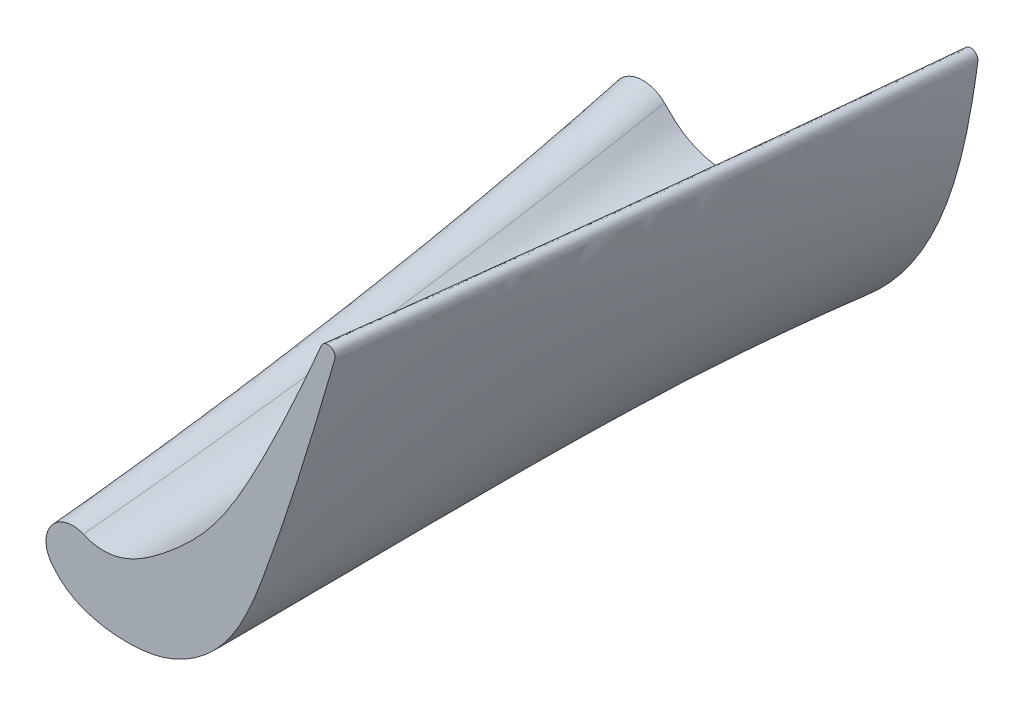
ISO-10303-21;
HEADER;
FILE_DESCRIPTION(('STEP AP214'),'2;1');
FILE_NAME('part.step','',(''),(''),'','','');
FILE_SCHEMA(('AUTOMOTIVE_DESIGN { 1 0 10303 214 1 1 1 1 }'));
ENDSEC;
DATA;
#1=APPLICATION_CONTEXT('core data for automotive mechanical design processes');
#2=APPLICATION_PROTOCOL_DEFINITION('international standard','automotive_design',2000,#1);
#3=PRODUCT_CONTEXT('',#1,'mechanical');
#4=PRODUCT('Part','Part','',(#3));
#5=PRODUCT_RELATED_PRODUCT_CATEGORY('part','',(#4));
#6=PRODUCT_DEFINITION_FORMATION('','',#4);
#7=PRODUCT_DEFINITION_CONTEXT('part definition',#1,'design');
#8=PRODUCT_DEFINITION('design','',#6,#7);
#9=PRODUCT_DEFINITION_SHAPE('','',#8);
#10=(LENGTH_UNIT() NAMED_UNIT(*) SI_UNIT(.MILLI.,.METRE.));
#11=(NAMED_UNIT(*) PLANE_ANGLE_UNIT() SI_UNIT($,.RADIAN.));
#12=(NAMED_UNIT(*) SI_UNIT($,.STERADIAN.) SOLID_ANGLE_UNIT());
#13=UNCERTAINTY_MEASURE_WITH_UNIT(LENGTH_MEASURE(1.E-05),#10,'distance_accuracy_value','');
#14=(GEOMETRIC_REPRESENTATION_CONTEXT(3) GLOBAL_UNCERTAINTY_ASSIGNED_CONTEXT((#13)) GLOBAL_UNIT_ASSIGNED_CONTEXT((#10,
#11,#12)) REPRESENTATION_CONTEXT('',''));
#15=CARTESIAN_POINT('',(0.,0.,0.));
#16=DIRECTION('',(0.,0.,1.));
#17=DIRECTION('',(1.,0.,0.));
#18=AXIS2_PLACEMENT_3D('',#15,#16,#17);
#19=CARTESIAN_POINT('',(8.89113504854674,16.2502413005269,21.));
#20=DIRECTION('',(0.,0.,1.));
#21=DIRECTION('',(1.,0.,0.));
#22=AXIS2_PLACEMENT_3D('',#19,#20,#21);
#23=PLANE('',#22);
#24=CARTESIAN_POINT('',(8.89113504854674,16.2502413005269,21.));
#25=DIRECTION('',(0.,0.,1.));
#26=DIRECTION('',(1.,0.,0.));
#27=AXIS2_PLACEMENT_3D('',#24,#25,#26);
#28=CIRCLE('',#27,0.499999999999538);
#29=CARTESIAN_POINT('',(9.37151293059252,16.1115434618948,21.));
#30=VERTEX_POINT('',#29);
#31=CARTESIAN_POINT('',(8.43141791114901,16.4468631548118,21.));
#32=VERTEX_POINT('',#31);
#33=EDGE_CURVE('E280',#30,#32,#28,.T.);
#34=ORIENTED_EDGE('',*,*,#33,.T.);
#35=CARTESIAN_POINT('',(-8.04478709637704,-3.08924513544326,21.));
#36=CARTESIAN_POINT('',(-7.40942088153978,-3.36302986753127,21.));
#37=CARTESIAN_POINT('',(-5.441580778131,-3.56576695449207,21.));
#38=CARTESIAN_POINT('',(-2.39747683335481,-1.52679760591979,21.));
#39=CARTESIAN_POINT('',(1.04049287411143,1.6806212635499,21.));
#40=CARTESIAN_POINT('',(4.58751936080533,7.67435269661124,21.));
#41=CARTESIAN_POINT('',(7.3264335180572,13.863323985652,21.));
#42=CARTESIAN_POINT('',(8.4314179111491,16.446863154813,21.));
#43=B_SPLINE_CURVE_WITH_KNOTS('',3,(#35,#36,#37,#38,#39,#40,#41,#42),.UNSPECIFIED.,.F.,.F.,(4,1,
1,1,1,4),(0.,0.0695102415454085,0.217198321992235,0.37469911171847,0.589805400977995,
0.999729954207877),.UNSPECIFIED.);
#44=CARTESIAN_POINT('',(-8.04478709637704,-3.08924513544326,21.));
#45=VERTEX_POINT('',#44);
#46=EDGE_CURVE('E291',#45,#32,#43,.T.);
#47=ORIENTED_EDGE('',*,*,#46,.F.);
#48=CARTESIAN_POINT('',(-8.77689094619604,-4.78822246109543,21.));
#49=DIRECTION('',(0.,0.,1.));
#50=DIRECTION('',(1.,0.,0.));
#51=AXIS2_PLACEMENT_3D('',#48,#49,#50);
#52=CIRCLE('',#51,1.85);
#53=CARTESIAN_POINT('',(-10.2994062445566,-5.83914927408384,21.));
#54=VERTEX_POINT('',#53);
#55=EDGE_CURVE('E281',#45,#54,#52,.T.);
#56=ORIENTED_EDGE('',*,*,#55,.T.);
#57=CARTESIAN_POINT('',(-10.2994062445566,-5.83914927408384,21.));
#58=CARTESIAN_POINT('',(-9.68190240457333,-6.73374919441278,21.));
#59=CARTESIAN_POINT('',(-8.05811486291636,-7.77309202398907,21.));
#60=CARTESIAN_POINT('',(-5.27053926558615,-8.16212100501361,21.));
#61=CARTESIAN_POINT('',(-1.86407310789102,-7.82114317170824,21.));
#62=CARTESIAN_POINT('',(2.28181491644027,-5.01327722845313,21.));
#63=CARTESIAN_POINT('',(4.47128332433579,0.598572453425043,21.));
#64=CARTESIAN_POINT('',(6.91434804376061,7.7557736586609,21.));
#65=CARTESIAN_POINT('',(8.40963530933274,12.7800947598445,21.));
#66=CARTESIAN_POINT('',(9.37151293059252,16.1115434618948,21.));
#67=B_SPLINE_CURVE_WITH_KNOTS('',3,(#57,#58,#59,#60,#61,#62,#63,#64,#65,#66),.UNSPECIFIED.,.F.,
.F.,(4,1,1,1,1,1,1,4),(0.,0.0800428842584507,0.160676536463411,0.228141202812313,
0.362508476433222,0.553953741601191,0.712539123403051,0.996067203654121),.UNSPECIFIED.);
#68=EDGE_CURVE('E276',#54,#30,#67,.T.);
#69=ORIENTED_EDGE('',*,*,#68,.T.);
#70=EDGE_LOOP('',(#34,#47,#56,#69));
#71=FACE_BOUND('',#70,.T.);
#72=ADVANCED_FACE('F235',(#71),#23,.T.);
#73=CARTESIAN_POINT('',(11.4136921607234,14.3096245383213,-21.));
#74=DIRECTION('',(0.,0.,1.));
#75=DIRECTION('',(1.,0.,0.));
#76=AXIS2_PLACEMENT_3D('',#73,#74,#75);
#77=PLANE('',#76);
#78=CARTESIAN_POINT('',(11.4136921607234,14.3096245383213,-21.));
#79=DIRECTION('',(0.,0.,1.));
#80=DIRECTION('',(1.,0.,0.));
#81=AXIS2_PLACEMENT_3D('',#78,#79,#80);
#82=CIRCLE('',#81,0.497369637643366);
#83=CARTESIAN_POINT('',(11.9063836776732,14.2415684910134,-21.));
#84=VERTEX_POINT('',#83);
#85=CARTESIAN_POINT('',(10.966416022714,14.5271575537854,-21.));
#86=VERTEX_POINT('',#85);
#87=EDGE_CURVE('E368',#84,#86,#82,.T.);
#88=ORIENTED_EDGE('',*,*,#87,.F.);
#89=CARTESIAN_POINT('',(-13.1885050207505,-1.66766831620271,-21.));
#90=CARTESIAN_POINT('',(-12.6856816351062,-2.60265044196109,-21.));
#91=CARTESIAN_POINT('',(-11.1626049405616,-5.08555576234239,-21.));
#92=CARTESIAN_POINT('',(-4.58262143904003,-9.324884667272,-21.));
#93=CARTESIAN_POINT('',(4.60753360550347,-4.56159920987308,-21.));
#94=CARTESIAN_POINT('',(10.207513131404,4.23778551879077,-21.));
#95=CARTESIAN_POINT('',(11.3398412883982,10.1400868412567,-21.));
#96=CARTESIAN_POINT('',(11.9063836776732,14.2415684910134,-21.));
#97=B_SPLINE_CURVE_WITH_KNOTS('',3,(#89,#90,#91,#92,#93,#94,#95,#96),.UNSPECIFIED.,.F.,.F.,(4,1,
1,1,1,4),(0.,0.082846870089142,0.212684995574931,0.550655831525839,0.699333195746872,1.),.UNSPECIFIED.);
#98=CARTESIAN_POINT('',(-13.1885050207505,-1.66766831620271,-21.));
#99=VERTEX_POINT('',#98);
#100=EDGE_CURVE('E12',#99,#84,#97,.T.);
#101=ORIENTED_EDGE('',*,*,#100,.F.);
#102=CARTESIAN_POINT('',(-11.294961061793,-0.649340630486733,-21.));
#103=DIRECTION('',(0.,0.,1.));
#104=DIRECTION('',(1.,0.,0.));
#105=AXIS2_PLACEMENT_3D('',#102,#103,#104);
#106=CIRCLE('',#105,2.15);
#107=CARTESIAN_POINT('',(-9.79597368818251,0.891937038772225,-21.));
#108=VERTEX_POINT('',#107);
#109=EDGE_CURVE('E246',#108,#99,#106,.T.);
#110=ORIENTED_EDGE('',*,*,#109,.F.);
#111=CARTESIAN_POINT('',(-9.79597368818251,0.891937038772225,-21.));
#112=CARTESIAN_POINT('',(-9.36566445013562,0.473434826325087,-21.));
#113=CARTESIAN_POINT('',(-8.70544319266144,-0.265030892203256,-21.));
#114=CARTESIAN_POINT('',(-6.48285420055909,-1.28226998798972,-21.));
#115=CARTESIAN_POINT('',(-2.86489811487648,-0.738380913917585,-21.));
#116=CARTESIAN_POINT('',(4.15881380655178,3.29692032875372,-21.));
#117=CARTESIAN_POINT('',(8.96987095240958,10.4220015318257,-21.));
#118=CARTESIAN_POINT('',(10.966416022714,14.5271575537854,-21.));
#119=B_SPLINE_CURVE_WITH_KNOTS('',3,(#111,#112,#113,#114,#115,#116,#117,#118),.UNSPECIFIED.,.F.,
.F.,(4,1,1,1,1,4),(0.,0.0653104893183065,0.148080258072521,0.227071841773076,0.440631945416788,
1.),.UNSPECIFIED.);
#120=EDGE_CURVE('E366',#108,#86,#119,.T.);
#121=ORIENTED_EDGE('',*,*,#120,.T.);
#122=EDGE_LOOP('',(#88,#101,#110,#121));
#123=FACE_BOUND('',#122,.T.);
#124=ADVANCED_FACE('F378',(#123),#77,.F.);
#125=CARTESIAN_POINT('',(-9.79597368818251,0.891937038772225,-21.));
#126=CARTESIAN_POINT('',(-9.28335139778739,0.167194275170694,-14.007463386576));
#127=CARTESIAN_POINT('',(-8.4797509335369,-1.21906294275179,-0.0361954458949513));
#128=CARTESIAN_POINT('',(-8.11589366991707,-2.4869271743063,13.992536613424));
#129=CARTESIAN_POINT('',(-8.04478709637704,-3.08924513544326,21.));
#130=CARTESIAN_POINT('',(-10.556189230678,1.63129343259522,-21.));
#131=CARTESIAN_POINT('',(-10.0579375704492,0.763172875400342,-14.011702533805));
#132=CARTESIAN_POINT('',(-9.39908830492432,-0.689759016730798,-0.0319562780531277));
#133=CARTESIAN_POINT('',(-8.96117367764846,-2.19241363860465,13.988297466195));
#134=CARTESIAN_POINT('',(-8.80210857912886,-2.76290883612837,21.));
#135=CARTESIAN_POINT('',(-11.7433362714319,1.70566153926173,-21.));
#136=CARTESIAN_POINT('',(-11.2594552413694,0.694163188473495,-14.0159416810341));
#137=CARTESIAN_POINT('',(-10.4979542067126,-0.974316336457008,-0.0277171102113042));
#138=CARTESIAN_POINT('',(-9.93169156605241,-2.43889486029849,13.9840583189659));
#139=CARTESIAN_POINT('',(-9.68466794255325,-2.97756729420897,21.));
#140=CARTESIAN_POINT('',(-13.4364226177162,0.428257602920261,-21.));
#141=CARTESIAN_POINT('',(-12.8004772122192,-0.698825350270828,-14.0251832559326));
#142=CARTESIAN_POINT('',(-11.6459837399318,-2.73369120859002,-0.0184754903758557));
#143=CARTESIAN_POINT('',(-10.9517528989807,-3.80873905888607,13.9748167440674));
#144=CARTESIAN_POINT('',(-10.7303589637616,-4.25297119968987,21.));
#145=CARTESIAN_POINT('',(-13.6907821570999,-0.733701921497164,-21.));
#146=CARTESIAN_POINT('',(-12.8884017460024,-1.83299168349776,-14.030185683602));
#147=CARTESIAN_POINT('',(-11.5182314969314,-3.90735702225242,-0.0134730383822326));
#148=CARTESIAN_POINT('',(-10.8756640407487,-4.77887137171149,13.969814316398));
#149=CARTESIAN_POINT('',(-10.7678583187893,-5.16048598302186,21.));
#150=CARTESIAN_POINT('',(-13.1885050207505,-1.66766831620271,-21.));
#151=CARTESIAN_POINT('',(-12.2196896040522,-2.73916488701281,-14.0351881112714));
#152=CARTESIAN_POINT('',(-10.7650981650377,-4.51205773553931,-0.00847058638860511));
#153=CARTESIAN_POINT('',(-10.2936237532563,-5.5201521922669,13.9648118887286));
#154=CARTESIAN_POINT('',(-10.2994062445566,-5.83914927408384,21.));
#155=B_SPLINE_SURFACE_WITH_KNOTS('',3,3,((#125,#126,#127,#128,#129),(#130,#131,#132,#133,#134),
(#135,#136,#137,#138,#139),(#140,#141,#142,#143,#144),(#145,#146,#147,#148,#149),(#150,#151,
#152,#153,#154)),.UNSPECIFIED.,.F.,.F.,.F.,(4,2,4),(4,1,4),(0.,0.5,1.),(0.,0.50077962076101,1.),.UNSPECIFIED.);
#156=CARTESIAN_POINT('',(-13.1885050207505,-1.66766831620271,-21.));
#157=CARTESIAN_POINT('',(-12.2196896040522,-2.73916488701281,-14.0351881112714));
#158=CARTESIAN_POINT('',(-10.7650981650377,-4.51205773553931,-0.00847058638860511));
#159=CARTESIAN_POINT('',(-10.2936237532563,-5.5201521922669,13.9648118887286));
#160=CARTESIAN_POINT('',(-10.2994062445566,-5.83914927408384,21.));
#161=B_SPLINE_CURVE_WITH_KNOTS('',3,(#156,#157,#158,#159,#160),.UNSPECIFIED.,.F.,.F.,(4,1,4),
(0.,0.50077962076101,1.),.UNSPECIFIED.);
#162=EDGE_CURVE('E270',#99,#54,#161,.T.);
#163=CARTESIAN_POINT('',(-9.79597368818251,0.891937038772225,-21.));
#164=CARTESIAN_POINT('',(-9.28335139778739,0.167194275170694,-14.007463386576));
#165=CARTESIAN_POINT('',(-8.4797509335369,-1.21906294275179,-0.0361954458949513));
#166=CARTESIAN_POINT('',(-8.11589366991707,-2.4869271743063,13.992536613424));
#167=CARTESIAN_POINT('',(-8.04478709637704,-3.08924513544326,21.));
#168=B_SPLINE_CURVE_WITH_KNOTS('',3,(#163,#164,#165,#166,#167),.UNSPECIFIED.,.F.,.F.,(4,1,4),
(0.,0.50077962076101,1.),.UNSPECIFIED.);
#169=EDGE_CURVE('E284',#45,#108,#168,.F.);
#170=ORIENTED_EDGE('',*,*,#109,.T.);
#171=ORIENTED_EDGE('',*,*,#162,.T.);
#172=ORIENTED_EDGE('',*,*,#55,.F.);
#173=ORIENTED_EDGE('',*,*,#169,.T.);
#174=EDGE_LOOP('',(#170,#171,#172,#173));
#175=FACE_BOUND('',#174,.T.);
#176=ADVANCED_FACE('F311',(#175),#155,.T.);
#177=CARTESIAN_POINT('',(-13.1885050207505,-1.66766831620271,-21.));
#178=CARTESIAN_POINT('',(-12.2196896040522,-2.73916488701281,-14.0351881112714));
#179=CARTESIAN_POINT('',(-10.7650981650377,-4.5120577355393,-0.00847058638860338));
#180=CARTESIAN_POINT('',(-10.2936237532563,-5.52015219226689,13.9648118887286));
#181=CARTESIAN_POINT('',(-10.2994062445566,-5.83914927408384,21.));
#182=CARTESIAN_POINT('',(-13.0901938184561,-1.85047448538926,-21.));
#183=CARTESIAN_POINT('',(-12.107422925602,-2.90417177283829,-14.0349105053905));
#184=CARTESIAN_POINT('',(-10.6351818773627,-4.65432047778818,-0.00874819361935093));
#185=CARTESIAN_POINT('',(-10.1761983861753,-5.66880868940259,13.9650894946095));
#186=CARTESIAN_POINT('',(-10.1912463296336,-5.99584441508174,21.));
#187=CARTESIAN_POINT('',(-12.888982566521,-2.21395233421323,-21.));
#188=CARTESIAN_POINT('',(-11.8783007213552,-3.23205105494011,-14.0343552936287));
#189=CARTESIAN_POINT('',(-10.3755618392321,-4.93650220941279,-0.00930340808082607));
#190=CARTESIAN_POINT('',(-9.92213558687303,-5.95300290788768,13.9656447063713));
#191=CARTESIAN_POINT('',(-9.95571443464731,-6.29611592129125,21.));
#192=CARTESIAN_POINT('',(-12.5699435135724,-2.75015860510936,-21.));
#193=CARTESIAN_POINT('',(-11.5245249953852,-3.71711197288337,-14.0337573763308));
#194=CARTESIAN_POINT('',(-9.971165762966,-5.34728421997886,-0.00990132828616011));
#195=CARTESIAN_POINT('',(-9.51056696500324,-6.34869992462164,13.9662426236692));
#196=CARTESIAN_POINT('',(-9.54874399304939,-6.69734337364942,21.));
#197=CARTESIAN_POINT('',(-12.2302266525713,-3.27474733997325,-21.));
#198=CARTESIAN_POINT('',(-11.1545044954316,-4.19215259291102,-14.0334050649238));
#199=CARTESIAN_POINT('',(-9.55159740127812,-5.74211298481522,-0.0102536414062228));
#200=CARTESIAN_POINT('',(-9.06234953950706,-6.70199750682326,13.9665949350762));
#201=CARTESIAN_POINT('',(-9.09206454863514,-7.03956753945432,21.));
#202=CARTESIAN_POINT('',(-11.865834407424,-3.78327767532455,-21.));
#203=CARTESIAN_POINT('',(-10.7732107140463,-4.66320001295164,-14.033324594809));
#204=CARTESIAN_POINT('',(-9.13142907754531,-6.13803187899738,-0.0103341119123439));
#205=CARTESIAN_POINT('',(-8.5942024162283,-7.02387101053853,13.9666754051911));
#206=CARTESIAN_POINT('',(-8.59730311584424,-7.32427001632136,21.));
#207=CARTESIAN_POINT('',(-11.4727692020367,-4.27130874768292,-21.));
#208=CARTESIAN_POINT('',(-10.36537869953,-5.11425987056256,-14.0332446561859));
#209=CARTESIAN_POINT('',(-8.68734273315886,-6.508530696286,-0.0104140509241358));
#210=CARTESIAN_POINT('',(-8.10092033794307,-7.30200644473701,13.9667553438141));
#211=CARTESIAN_POINT('',(-8.07608670911642,-7.55293240186593,21.));
#212=CARTESIAN_POINT('',(-11.049937722627,-4.73460361294817,-21.));
#213=CARTESIAN_POINT('',(-9.91436567195699,-5.51944088741019,-14.032943198951));
#214=CARTESIAN_POINT('',(-8.18851858653979,-6.80784921439528,-0.0107155096248345));
#215=CARTESIAN_POINT('',(-7.57174679246311,-7.51798874741411,13.967056801049));
#216=CARTESIAN_POINT('',(-7.53600805039856,-7.73242438665221,21.));
#217=CARTESIAN_POINT('',(-10.5962466554124,-5.16892532702009,-21.));
#218=CARTESIAN_POINT('',(-9.42118613236376,-5.85852491817081,-14.0320799275992));
#219=CARTESIAN_POINT('',(-7.63966983565938,-7.00161399130661,-0.0115787851742943));
#220=CARTESIAN_POINT('',(-7.01346136152026,-7.65898495946294,13.9679200724008));
#221=CARTESIAN_POINT('',(-6.98465986163759,-7.86961566124438,21.));
#222=CARTESIAN_POINT('',(-10.1142476696527,-5.5728123754343,-21.));
#223=CARTESIAN_POINT('',(-8.9030252294984,-6.15193311804714,-14.0310751437653));
#224=CARTESIAN_POINT('',(-7.07263702341743,-7.13298746873768,-0.0125835738939097));
#225=CARTESIAN_POINT('',(-6.44378814235351,-7.74838924776853,13.9689248562347));
#226=CARTESIAN_POINT('',(-6.42539194196121,-7.96749649717382,21.));
#227=CARTESIAN_POINT('',(-9.60649243460775,-5.94480324372643,-21.));
#228=CARTESIAN_POINT('',(-8.36784303996309,-6.41513762185842,-14.0302177374553));
#229=CARTESIAN_POINT('',(-6.50084465199979,-7.23517417419628,-0.0134409843730217));
#230=CARTESIAN_POINT('',(-5.87121746028526,-7.80464022396599,13.9697822625447));
#231=CARTESIAN_POINT('',(-5.86155409049713,-8.0290571659719,21.));
#232=CARTESIAN_POINT('',(-8.897200869928,-6.39488308419765,-21.));
#233=CARTESIAN_POINT('',(-7.63285930374463,-6.72216441642025,-14.0292089518874));
#234=CARTESIAN_POINT('',(-5.73278526088833,-7.33002720355102,-0.0144497748461785));
#235=CARTESIAN_POINT('',(-5.10581247585016,-7.83753324591433,13.9707910481126));
#236=CARTESIAN_POINT('',(-5.10663061341715,-8.0679363174188,21.));
#237=CARTESIAN_POINT('',(-7.95390984496703,-6.86506839539835,-21.));
#238=CARTESIAN_POINT('',(-6.67945075149047,-7.02430897161352,-14.0281449302654));
#239=CARTESIAN_POINT('',(-4.76943006140594,-7.38138983244405,-0.0155138016419628));
#240=CARTESIAN_POINT('',(-4.15192906138924,-7.81114947116942,13.9718550697346));
#241=CARTESIAN_POINT('',(-4.16262731480687,-8.0453291484913,21.));
#242=CARTESIAN_POINT('',(-6.74810498046917,-7.25625062967893,-21.));
#243=CARTESIAN_POINT('',(-5.49278360377559,-7.24643099709024,-14.0270391721006));
#244=CARTESIAN_POINT('',(-3.61629312735279,-7.34150856127429,-0.0166195651834707));
#245=CARTESIAN_POINT('',(-3.0213250344133,-7.66384519504813,13.9729608278994));
#246=CARTESIAN_POINT('',(-3.04091712506029,-7.88237192555519,21.));
#247=CARTESIAN_POINT('',(-5.49230737897812,-7.44799339125097,-21.));
#248=CARTESIAN_POINT('',(-4.28057529688112,-7.30017483884872,-14.025806684967));
#249=CARTESIAN_POINT('',(-2.47708692399274,-7.1691260583941,-0.017852058309972));
#250=CARTESIAN_POINT('',(-1.92489056028245,-7.36699920991553,13.974193315033));
#251=CARTESIAN_POINT('',(-1.95878027455011,-7.54822994833439,21.));
#252=CARTESIAN_POINT('',(-4.22156429115791,-7.45436828778213,-21.));
#253=CARTESIAN_POINT('',(-3.07253944596422,-7.17775437469691,-14.0243213945168));
#254=CARTESIAN_POINT('',(-1.37437088894732,-6.83466584710391,-0.0193373559824038));
#255=CARTESIAN_POINT('',(-0.885083634044835,-6.91304084003981,13.9756786054832));
#256=CARTESIAN_POINT('',(-0.940380572764257,-7.05729798492424,21.));
#257=CARTESIAN_POINT('',(-2.95856084733947,-7.29460749732197,-21.));
#258=CARTESIAN_POINT('',(-1.89410508618978,-6.88888650119634,-14.0225978463728));
#259=CARTESIAN_POINT('',(-0.334379313014917,-6.33972082128985,-0.021060912507116));
#260=CARTESIAN_POINT('',(0.0802203877685996,-6.31715520198195,13.9774021536272));
#261=CARTESIAN_POINT('',(0.0029273620098403,-6.43701055150609,21.));
#262=CARTESIAN_POINT('',(-1.72191888865555,-6.99307979873963,-21.));
#263=CARTESIAN_POINT('',(-0.763900426737426,-6.4561067917847,-14.0209345639344));
#264=CARTESIAN_POINT('',(0.625906802441018,-5.7041695149859,-0.022724203033187));
#265=CARTESIAN_POINT('',(0.958598499596757,-5.59865908952266,13.9790654360656));
#266=CARTESIAN_POINT('',(0.861829506684218,-5.70690823419598,21.));
#267=CARTESIAN_POINT('',(-0.118340325092586,-6.42739272908324,-21.));
#268=CARTESIAN_POINT('',(0.672864882154248,-5.72224623064213,-14.0191368851052));
#269=CARTESIAN_POINT('',(1.7983163286753,-4.7126496072244,-0.0245218906035995));
#270=CARTESIAN_POINT('',(2.00734560638791,-4.50693936503062,13.9808631148948));
#271=CARTESIAN_POINT('',(1.8833807302908,-4.60443248984501,21.));
#272=CARTESIAN_POINT('',(1.78224641213893,-5.46101314401848,-21.));
#273=CARTESIAN_POINT('',(2.33850369375539,-4.57437239149841,-14.0181810853727));
#274=CARTESIAN_POINT('',(3.0828881476638,-3.28158688965449,-0.0254776949836354));
#275=CARTESIAN_POINT('',(3.08986558665101,-2.95232279910174,13.9818189146273));
#276=CARTESIAN_POINT('',(2.90928950099389,-3.02793827856489,21.));
#277=CARTESIAN_POINT('',(3.87140576728067,-3.97997013948882,-21.));
#278=CARTESIAN_POINT('',(4.13761314431418,-2.93733377855718,-14.0187295947479));
#279=CARTESIAN_POINT('',(4.3988406907326,-1.39434605487801,-0.0249291829413233));
#280=CARTESIAN_POINT('',(4.11759933411589,-0.93947547124198,13.9812704052521));
#281=CARTESIAN_POINT('',(3.84138414099998,-0.983184419563749,21.));
#282=CARTESIAN_POINT('',(5.74261968346343,-2.22749451217352,-21.));
#283=CARTESIAN_POINT('',(5.7353225038222,-1.09686257361325,-14.0199848612445));
#284=CARTESIAN_POINT('',(5.54016638154364,0.593191243019539,-0.0236739103409841));
#285=CARTESIAN_POINT('',(4.98554002964632,1.13570899539066,13.9800151387555));
#286=CARTESIAN_POINT('',(4.61794936662107,1.12136932866469,21.));
#287=CARTESIAN_POINT('',(7.33955867291658,-0.219481471471455,-21.));
#288=CARTESIAN_POINT('',(7.10679241911109,0.921031104873314,-14.0206922084041));
#289=CARTESIAN_POINT('',(6.54440280030563,2.63879255303768,-0.0229665597419158));
#290=CARTESIAN_POINT('',(5.79169009073577,3.22372116174867,13.9793077915959));
#291=CARTESIAN_POINT('',(5.36689251365098,3.23452940555993,21.));
#292=CARTESIAN_POINT('',(8.63877800215642,1.99030281353677,-21.));
#293=CARTESIAN_POINT('',(8.26030150679219,3.07392126250214,-14.0193273347926));
#294=CARTESIAN_POINT('',(7.45522270492544,4.71985404909024,-0.0243314399901406));
#295=CARTESIAN_POINT('',(6.55781995600829,5.31949255963431,13.9806726652074));
#296=CARTESIAN_POINT('',(6.08510294836958,5.35875010502928,21.));
#297=CARTESIAN_POINT('',(9.66942531430685,4.33337732198175,-21.));
#298=CARTESIAN_POINT('',(9.2210494518329,5.31759152459571,-14.0159232453074));
#299=CARTESIAN_POINT('',(8.29088447433109,6.82942366796798,-0.0277355460276647));
#300=CARTESIAN_POINT('',(7.29389248383633,7.423632728132,13.9840767546927));
#301=CARTESIAN_POINT('',(6.77851343945856,7.49210195239082,21.));
#302=CARTESIAN_POINT('',(10.4671750616709,6.76081053806654,-21.));
#303=CARTESIAN_POINT('',(10.0318204012694,7.61926955533361,-14.01040978469));
#304=CARTESIAN_POINT('',(9.09321618067807,8.95249684534157,-0.0332490334541445));
#305=CARTESIAN_POINT('',(8.01988155905451,9.53422971217121,13.98959021531));
#306=CARTESIAN_POINT('',(7.44992521737325,9.63450912711016,21.));
#307=CARTESIAN_POINT('',(11.0753358465598,9.23644468654669,-21.));
#308=CARTESIAN_POINT('',(10.7078205349549,9.95106963063042,-14.0041213370983));
#309=CARTESIAN_POINT('',(9.85194123733447,11.1008098537918,-0.0395375116233193));
#310=CARTESIAN_POINT('',(8.72823473808855,11.6533891771044,13.9958786629018));
#311=CARTESIAN_POINT('',(8.10349989801508,11.7852277660042,21.));
#312=CARTESIAN_POINT('',(11.5427520437712,11.7353315541083,-21.));
#313=CARTESIAN_POINT('',(11.2849284564294,12.3351420961975,-13.998999573902));
#314=CARTESIAN_POINT('',(10.5460295127046,13.2548026963723,-0.0446592997239758));
#315=CARTESIAN_POINT('',(9.4122958105923,13.7958894699968,14.0010004260979));
#316=CARTESIAN_POINT('',(8.74297366897184,13.9439792220337,21.));
#317=CARTESIAN_POINT('',(11.7910190413851,13.4063866092623,-21.));
#318=CARTESIAN_POINT('',(11.5961970339042,13.8631361494972,-13.9951744089555));
#319=CARTESIAN_POINT('',(11.004856548201,14.7460326152643,-0.0484844832703777));
#320=CARTESIAN_POINT('',(9.85713291848132,15.2095180092075,14.0048255910446));
#321=CARTESIAN_POINT('',(9.16266298451637,15.3881948088017,21.));
#322=CARTESIAN_POINT('',(11.9244681501041,14.3724909660564,-21.));
#323=CARTESIAN_POINT('',(11.8003714028715,14.8212097160356,-13.994250952746));
#324=CARTESIAN_POINT('',(11.2539539238728,15.5605290085933,-0.049407943970104));
#325=CARTESIAN_POINT('',(10.1181647279469,16.0522341977832,14.005749047254));
#326=CARTESIAN_POINT('',(9.40425577675434,16.2249478180602,21.));
#327=CARTESIAN_POINT('',(11.8538633648827,14.6206951103666,-21.));
#328=CARTESIAN_POINT('',(11.7503927101033,15.0704117008572,-13.9940554265909));
#329=CARTESIAN_POINT('',(11.2425570627091,15.835869468078,-0.0496034710759191));
#330=CARTESIAN_POINT('',(10.1076692756417,16.3158241913397,14.005944573409));
#331=CARTESIAN_POINT('',(9.38828365306002,16.4859165120366,21.));
#332=CARTESIAN_POINT('',(11.5615664610715,14.8244735554578,-21.));
#333=CARTESIAN_POINT('',(11.4473593954052,15.3142832383694,-13.9950432667809));
#334=CARTESIAN_POINT('',(10.9223750461662,16.1220506415865,-0.0486156260826394));
#335=CARTESIAN_POINT('',(9.79576568967065,16.6098124498001,14.0049567332191));
#336=CARTESIAN_POINT('',(9.08476040436956,16.7690278477187,21.));
#337=CARTESIAN_POINT('',(11.2085523819694,14.8066538164892,-21.));
#338=CARTESIAN_POINT('',(11.0591247261721,15.2861525593518,-13.9952867756922));
#339=CARTESIAN_POINT('',(10.4920640816298,16.0936595406102,-0.0483721159872501));
#340=CARTESIAN_POINT('',(9.36410277212047,16.5859564986207,14.0047132243078));
#341=CARTESIAN_POINT('',(8.66517600342273,16.7542151589868,21.));
#342=CARTESIAN_POINT('',(11.0215760633745,14.6405737628442,-21.));
#343=CARTESIAN_POINT('',(10.8793594108806,15.1082386737481,-13.9948827382544));
#344=CARTESIAN_POINT('',(10.3115179176588,15.8809967357549,-0.0487761553897099));
#345=CARTESIAN_POINT('',(9.18348839663878,16.3843652019988,14.0051172617456));
#346=CARTESIAN_POINT('',(8.47934791817347,16.5589272267569,21.));
#347=CARTESIAN_POINT('',(10.4506277773398,13.4666299187988,-21.));
#348=CARTESIAN_POINT('',(10.348264524693,13.8820865075275,-13.9930014419838));
#349=CARTESIAN_POINT('',(9.88983975705878,14.7282557261386,-0.0506574608080517));
#350=CARTESIAN_POINT('',(8.71317271655213,15.1962673716577,14.0069985580162));
#351=CARTESIAN_POINT('',(7.98323039735094,15.3989660041696,21.));
#352=CARTESIAN_POINT('',(9.60237535301446,11.9173082199695,-21.));
#353=CARTESIAN_POINT('',(9.58610458522471,12.3765532621539,-13.9931110698118));
#354=CARTESIAN_POINT('',(9.17756543267875,13.1263821210478,-0.0505478324469945));
#355=CARTESIAN_POINT('',(8.04705476945163,13.6454219995585,14.0068889301882));
#356=CARTESIAN_POINT('',(7.29712865324193,13.8293904743355,21.));
#357=CARTESIAN_POINT('',(8.35176906127638,9.92937742051561,-21.));
#358=CARTESIAN_POINT('',(8.38018010225967,10.3785250117981,-13.9945689053167));
#359=CARTESIAN_POINT('',(8.0800668514528,11.1326837747227,-0.0490899898533574));
#360=CARTESIAN_POINT('',(7.04638028922949,11.5910701917999,14.0054310946833));
#361=CARTESIAN_POINT('',(6.35044252451177,11.7465416803613,21.));
#362=CARTESIAN_POINT('',(7.35342502134777,8.47998667678475,-21.));
#363=CARTESIAN_POINT('',(7.40682029370561,8.93684502539377,-13.9965031099971));
#364=CARTESIAN_POINT('',(7.17331902623558,9.67547104208052,-0.0471557757679091));
#365=CARTESIAN_POINT('',(6.25258948156633,10.0775004536342,14.0034968900029));
#366=CARTESIAN_POINT('',(5.62224675840571,10.1914128761182,21.));
#367=CARTESIAN_POINT('',(6.29410386882125,7.07479491194707,-21.));
#368=CARTESIAN_POINT('',(6.36162309255718,7.54096702122019,-13.9987596106855));
#369=CARTESIAN_POINT('',(6.19416434417647,8.2674623214878,-0.0448992641073358));
#370=CARTESIAN_POINT('',(5.41477425588927,8.58802750259873,14.0012403893145));
#371=CARTESIAN_POINT('',(4.87378560997127,8.64526691628081,21.));
#372=CARTESIAN_POINT('',(5.17132909556339,5.71932752890181,-21.));
#373=CARTESIAN_POINT('',(5.24823903106608,6.19778410287426,-14.0009374840397));
#374=CARTESIAN_POINT('',(5.14753313711872,6.90690946110606,-0.0427213801633043));
#375=CARTESIAN_POINT('',(4.53383547021825,7.12617971526119,13.9990625159603));
#376=CARTESIAN_POINT('',(4.09973581441722,7.1119527614457,21.));
#377=CARTESIAN_POINT('',(3.98067023778594,4.42085452608109,-21.));
#378=CARTESIAN_POINT('',(4.06626069586677,4.91125914468674,-14.0026313918002));
#379=CARTESIAN_POINT('',(4.03846193685107,5.59629352231064,-0.0410274641661663));
#380=CARTESIAN_POINT('',(3.61037966720308,5.69365046252089,13.9973686081998));
#381=CARTESIAN_POINT('',(3.29684545813621,5.59443296471243,21.));
#382=CARTESIAN_POINT('',(2.7169642055005,3.1898045691623,-21.));
#383=CARTESIAN_POINT('',(2.81901903983043,3.68572700365297,-14.0033856039915));
#384=CARTESIAN_POINT('',(2.87596368598682,4.33350220369063,-0.0402732483075557));
#385=CARTESIAN_POINT('',(2.63772783328516,4.29607611596559,13.9966143960085));
#386=CARTESIAN_POINT('',(2.44502828217377,4.10533057614728,21.));
#387=CARTESIAN_POINT('',(1.59754227959406,2.23207455436345,-21.));
#388=CARTESIAN_POINT('',(1.73101543195002,2.71683964800512,-14.0031169245882));
#389=CARTESIAN_POINT('',(1.87592170410912,3.31370195198577,-0.0405419290173214));
#390=CARTESIAN_POINT('',(1.77695470864755,3.16744188886943,13.9968830754118));
#391=CARTESIAN_POINT('',(1.66645108463014,2.90797762545899,21.));
#392=CARTESIAN_POINT('',(0.658976797329752,1.51644559093323,-21.));
#393=CARTESIAN_POINT('',(0.833576247253919,1.97552347388098,-14.0026135598754));
#394=CARTESIAN_POINT('',(1.06265631780355,2.51331772718314,-0.0410452961776522));
#395=CARTESIAN_POINT('',(1.05261114545643,2.29201130284124,13.9973864401245));
#396=CARTESIAN_POINT('',(0.987529165353692,1.99117738903206,21.));
#397=CARTESIAN_POINT('',(-0.0683418884759807,1.00973720524559,-21.));
#398=CARTESIAN_POINT('',(0.147012182111514,1.43778095889021,-14.0021966453448));
#399=CARTESIAN_POINT('',(0.448055639455819,1.91857314476525,-0.0414622127355147));
#400=CARTESIAN_POINT('',(0.491586190553095,1.64990015624254,13.9978033546552));
#401=CARTESIAN_POINT('',(0.448519118633346,1.32791598662637,21.));
#402=CARTESIAN_POINT('',(-0.821206925759006,0.53906967817393,-21.));
#403=CARTESIAN_POINT('',(-0.554637107470433,0.921807716258519,-14.0018686915316));
#404=CARTESIAN_POINT('',(-0.172181108516694,1.33002653542078,-0.041790168143382));
#405=CARTESIAN_POINT('',(-0.0885645326206095,1.0242886428462,13.9981313084684));
#406=CARTESIAN_POINT('',(-0.122098061992259,0.692791071987838,21.));
#407=CARTESIAN_POINT('',(-1.60069100643929,0.110874736203302,-21.));
#408=CARTESIAN_POINT('',(-1.27718935284115,0.436557247381288,-14.0017078690003));
#409=CARTESIAN_POINT('',(-0.807820987152742,0.757978687388545,-0.0419509914567137));
#410=CARTESIAN_POINT('',(-0.690495595801847,0.419416632397211,13.9982921309997));
#411=CARTESIAN_POINT('',(-0.720650371295342,0.0851638126453433,21.));
#412=CARTESIAN_POINT('',(-2.40727998100886,-0.268046818737813,-21.));
#413=CARTESIAN_POINT('',(-2.0243664725263,-0.00975696459205572,-14.001748258925));
#414=CARTESIAN_POINT('',(-1.46512375248862,0.210816188061703,-0.0419106013355976));
#415=CARTESIAN_POINT('',(-1.31515702133114,-0.161462168278328,13.998251741075));
#416=CARTESIAN_POINT('',(-1.34346580404813,-0.495604623872235,21.));
#417=CARTESIAN_POINT('',(-3.23972371802057,-0.59064313499844,-21.));
#418=CARTESIAN_POINT('',(-2.79725641866266,-0.410015853381298,-14.002011176216));
#419=CARTESIAN_POINT('',(-2.14715822031488,-0.305772881766402,-0.041647682766229));
#420=CARTESIAN_POINT('',(-1.96224008869624,-0.717215563531573,13.9979888237841));
#421=CARTESIAN_POINT('',(-1.98719922332791,-1.05144270072196,21.));
#422=CARTESIAN_POINT('',(-4.0961200059517,-0.850796639512331,-21.));
#423=CARTESIAN_POINT('',(-3.59571886823291,-0.757757254248951,-14.0025126482197));
#424=CARTESIAN_POINT('',(-2.85529608890528,-0.786329044024039,-0.0411462083240335));
#425=CARTESIAN_POINT('',(-2.63064252631301,-1.24674541634628,13.9974873517802));
#426=CARTESIAN_POINT('',(-2.64850549221197,-1.58427888106089,21.));
#427=CARTESIAN_POINT('',(-4.9717574225826,-1.0438965237091,-21.));
#428=CARTESIAN_POINT('',(-4.41454001802614,-1.05287721456605,-14.0033794960825));
#429=CARTESIAN_POINT('',(-3.58455040865635,-1.23576750223853,-0.0402793562463048));
#430=CARTESIAN_POINT('',(-3.31818348526648,-1.75189967164541,13.9966205039176));
#431=CARTESIAN_POINT('',(-3.32722262662563,-2.09243021521978,21.0000000000001));
#432=CARTESIAN_POINT('',(-5.72036904756855,-1.11103765535684,-21.));
#433=CARTESIAN_POINT('',(-5.12147051547863,-1.22167880307126,-14.0044050030184));
#434=CARTESIAN_POINT('',(-4.22310461928265,-1.55997617224776,-0.0392538443238346));
#435=CARTESIAN_POINT('',(-3.91835886018215,-2.13631516624592,13.9955949969816));
#436=CARTESIAN_POINT('',(-3.91570155526244,-2.48299218279322,21.));
#437=CARTESIAN_POINT('',(-6.31999622965317,-1.07263723062282,-21.));
#438=CARTESIAN_POINT('',(-5.70031693610839,-1.27477665872928,-14.0052262793647));
#439=CARTESIAN_POINT('',(-4.76289173037007,-1.7570496872704,-0.0384325639841528));
#440=CARTESIAN_POINT('',(-4.42423180105139,-2.39982161737613,13.9947737206353));
#441=CARTESIAN_POINT('',(-4.40586854328168,-2.76020469860089,21.));
#442=CARTESIAN_POINT('',(-6.76495416540676,-0.997699567254045,-21.));
#443=CARTESIAN_POINT('',(-6.13822468030134,-1.26515297000581,-14.0056332074033));
#444=CARTESIAN_POINT('',(-5.18269748508439,-1.85618294065778,-0.0380256339667785));
#445=CARTESIAN_POINT('',(-4.81798825837894,-2.56443394379717,13.9943667925966));
#446=CARTESIAN_POINT('',(-4.78459947063464,-2.94662091340219,21.));
#447=CARTESIAN_POINT('',(-7.20001825849267,-0.876543879274885,-21.));
#448=CARTESIAN_POINT('',(-6.57353824956591,-1.20637573709888,-14.0058203810582));
#449=CARTESIAN_POINT('',(-5.61095866312915,-1.90666909437228,-0.0378384594017738));
#450=CARTESIAN_POINT('',(-5.22409248841723,-2.69379240763046,13.9941796189418));
#451=CARTESIAN_POINT('',(-5.17584984810976,-3.10766931322009,21.));
#452=CARTESIAN_POINT('',(-7.62367062925447,-0.71724198411292,-21.));
#453=CARTESIAN_POINT('',(-7.00273902749777,-1.10883443048889,-14.0059341642101));
#454=CARTESIAN_POINT('',(-6.04206630217324,-1.91894513565242,-0.0377246756966888));
#455=CARTESIAN_POINT('',(-5.63873722970286,-2.78911722933459,13.99406583579));
#456=CARTESIAN_POINT('',(-5.57766706909018,-3.23766458432906,21.));
#457=CARTESIAN_POINT('',(-8.03439339803576,-0.527865699195743,-21.));
#458=CARTESIAN_POINT('',(-7.4229586129313,-0.977550040439923,-14.0059651929584));
#459=CARTESIAN_POINT('',(-6.4717271563371,-1.89269072021268,-0.0376936467974405));
#460=CARTESIAN_POINT('',(-6.0587598838484,-2.84624987360392,13.9940348070416));
#461=CARTESIAN_POINT('',(-5.98809852695902,-3.33092141300355,21.));
#462=CARTESIAN_POINT('',(-8.42910277449598,-0.303634425504819,-21.));
#463=CARTESIAN_POINT('',(-7.83237903497332,-0.820126674811082,-14.0063269499729));
#464=CARTESIAN_POINT('',(-6.89953261723982,-1.8478236188599,-0.0373318880239245));
#465=CARTESIAN_POINT('',(-6.48311294652129,-2.87222155361644,13.9936730500271));
#466=CARTESIAN_POINT('',(-6.40519161509944,-3.38175448551802,21.));
#467=CARTESIAN_POINT('',(-8.80322990636437,-0.0461694581939158,-21.));
#468=CARTESIAN_POINT('',(-8.22589040234331,-0.625386665902987,-14.0066972087788));
#469=CARTESIAN_POINT('',(-7.32025761110607,-1.75912856118944,-0.036961627417604));
#470=CARTESIAN_POINT('',(-6.90836969314587,-2.85087064005997,13.9933027912211));
#471=CARTESIAN_POINT('',(-6.82699372689457,-3.38447848814692,21.));
#472=CARTESIAN_POINT('',(-9.14786000802121,0.251256196314532,-21.));
#473=CARTESIAN_POINT('',(-8.5912183115017,-0.37608463548464,-14.0066366521012));
#474=CARTESIAN_POINT('',(-7.71875782410812,-1.59952690309728,-0.0370221843897088));
#475=CARTESIAN_POINT('',(-7.32332624800582,-2.76901868517885,13.9933633478988));
#476=CARTESIAN_POINT('',(-7.24585440219047,-3.33783486155147,21.));
#477=CARTESIAN_POINT('',(-9.47198613674351,0.570844980242074,-21.));
#478=CARTESIAN_POINT('',(-8.93889789660514,-0.10587242657724,-14.0067922155402));
#479=CARTESIAN_POINT('',(-8.10343900500245,-1.41590179303158,-0.0368666201942911));
#480=CARTESIAN_POINT('',(-7.72657248731747,-2.64604111234473,13.9932077844598));
#481=CARTESIAN_POINT('',(-7.65412318083322,-3.24056504639288,21.));
#482=CARTESIAN_POINT('',(-9.68691849483431,0.785874152690054,-21.));
#483=CARTESIAN_POINT('',(-9.16747422119144,0.0771398413492657,-14.0072396628974));
#484=CARTESIAN_POINT('',(-8.35476510695599,-1.28418545176387,-0.0364191706613935));
#485=CARTESIAN_POINT('',(-7.98817142817926,-2.54475465390401,13.9927603371026));
#486=CARTESIAN_POINT('',(-7.91661727699116,-3.14447460601138,21.));
#487=CARTESIAN_POINT('',(-9.79597368818251,0.891937038772225,-21.));
#488=CARTESIAN_POINT('',(-9.28335139778738,0.167194275170699,-14.007463386576));
#489=CARTESIAN_POINT('',(-8.47975093353689,-1.21906294275178,-0.0361954458949539));
#490=CARTESIAN_POINT('',(-8.11589366991707,-2.48692717430629,13.992536613424));
#491=CARTESIAN_POINT('',(-8.04478709637704,-3.08924513544326,21.));
#492=B_SPLINE_SURFACE_WITH_KNOTS('',3,3,((#177,#178,#179,#180,#181),(#182,#183,#184,#185,#186),
(#187,#188,#189,#190,#191),(#192,#193,#194,#195,#196),(#197,#198,#199,#200,#201),(#202,#203,
#204,#205,#206),(#207,#208,#209,#210,#211),(#212,#213,#214,#215,#216),(#217,#218,#219,#220,
#221),(#222,#223,#224,#225,#226),(#227,#228,#229,#230,#231),(#232,#233,#234,#235,#236),(#237,
#238,#239,#240,#241),(#242,#243,#244,#245,#246),(#247,#248,#249,#250,#251),(#252,#253,#254,#255,
#256),(#257,#258,#259,#260,#261),(#262,#263,#264,#265,#266),(#267,#268,#269,#270,#271),(#272,
#273,#274,#275,#276),(#277,#278,#279,#280,#281),(#282,#283,#284,#285,#286),(#287,#288,#289,#290,
#291),(#292,#293,#294,#295,#296),(#297,#298,#299,#300,#301),(#302,#303,#304,#305,#306),(#307,
#308,#309,#310,#311),(#312,#313,#314,#315,#316),(#317,#318,#319,#320,#321),(#322,#323,#324,#325,
#326),(#327,#328,#329,#330,#331),(#332,#333,#334,#335,#336),(#337,#338,#339,#340,#341),(#342,
#343,#344,#345,#346),(#347,#348,#349,#350,#351),(#352,#353,#354,#355,#356),(#357,#358,#359,#360,
#361),(#362,#363,#364,#365,#366),(#367,#368,#369,#370,#371),(#372,#373,#374,#375,#376),(#377,
#378,#379,#380,#381),(#382,#383,#384,#385,#386),(#387,#388,#389,#390,#391),(#392,#393,#394,#395,
#396),(#397,#398,#399,#400,#401),(#402,#403,#404,#405,#406),(#407,#408,#409,#410,#411),(#412,
#413,#414,#415,#416),(#417,#418,#419,#420,#421),(#422,#423,#424,#425,#426),(#427,#428,#429,#430,
#431),(#432,#433,#434,#435,#436),(#437,#438,#439,#440,#441),(#442,#443,#444,#445,#446),(#447,
#448,#449,#450,#451),(#452,#453,#454,#455,#456),(#457,#458,#459,#460,#461),(#462,#463,#464,#465,
#466),(#467,#468,#469,#470,#471),(#472,#473,#474,#475,#476),(#477,#478,#479,#480,#481),(#482,
#483,#484,#485,#486),(#487,#488,#489,#490,#491)),.UNSPECIFIED.,.F.,.F.,.F.,(4,1,1,1,1,1,1,1,1,1,
1,1,1,1,1,1,1,1,1,1,1,1,1,1,1,1,1,2,1,1,1,2,1,1,1,1,1,1,1,1,1,1,1,1,1,1,1,1,1,1,1,1,1,1,1,1,1,1,
4),(4,1,4),(0.,0.00881695005361373,0.0176339001072275,0.0264508501608412,0.0352678002144549,
0.0440847502680686,0.0529017003216824,0.0617186503752961,0.0705356004289098,0.0793525504825235,
0.0881695005361373,0.105803400643365,0.123437300750592,0.14107120085782,0.158705100965047,
0.176339001072275,0.193972901179502,0.211606801286729,0.246874601501184,0.282142401715639,
0.317410201930094,0.352678002144549,0.387945802359004,0.423213602573459,0.458481402787914,
0.493749203002369,0.529017003216824,0.564284803431278,0.569813525976879,0.575342248522479,
0.580870971068079,0.586399693613679,0.638099731911969,0.663949751061114,0.68979977021026,
0.715649789359405,0.74149980850855,0.767349827657694,0.79319984680684,0.819049865955985,
0.831974875530557,0.84489988510513,0.857824894679702,0.870749904254275,0.883674913828847,
0.89659992340342,0.909524932977992,0.922449942552565,0.935374952127137,0.941837456914424,
0.94829996170171,0.954762466488996,0.961224971276282,0.967687476063569,0.974149980850855,
0.980612485638141,0.987074990425427,0.993537495212714,1.),(0.,0.50077962076101,1.),.UNSPECIFIED.);
#493=ORIENTED_EDGE('',*,*,#100,.T.);
#494=ORIENTED_EDGE('',*,*,#87,.T.);
#495=ORIENTED_EDGE('',*,*,#120,.F.);
#496=ORIENTED_EDGE('',*,*,#169,.F.);
#497=ORIENTED_EDGE('',*,*,#46,.T.);
#498=ORIENTED_EDGE('',*,*,#33,.F.);
#499=ORIENTED_EDGE('',*,*,#68,.F.);
#500=ORIENTED_EDGE('',*,*,#162,.F.);
#501=EDGE_LOOP('',(#493,#494,#495,#496,#497,#498,#499,#500));
#502=FACE_BOUND('',#501,.T.);
#503=ADVANCED_FACE('F289',(#502),#492,.T.);
#504=CLOSED_SHELL('',(#72,#124,#176,#503));
#505=MANIFOLD_SOLID_BREP('B2',#504);
#506=ADVANCED_BREP_SHAPE_REPRESENTATION('',(#18,#505),#14);
#507=SHAPE_DEFINITION_REPRESENTATION(#9,#506);
ENDSEC;
END-ISO-10303-21;
